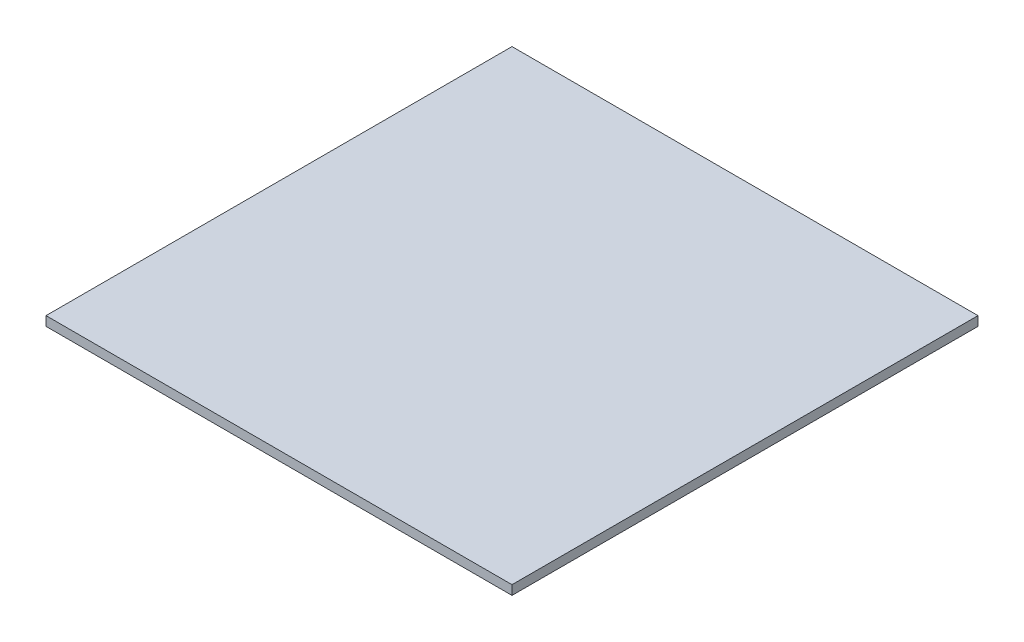
ISO-10303-21;
HEADER;
FILE_DESCRIPTION(('STEP AP214'),'2;1');
FILE_NAME('part.step','',(''),(''),'','','');
FILE_SCHEMA(('AUTOMOTIVE_DESIGN { 1 0 10303 214 1 1 1 1 }'));
ENDSEC;
DATA;
#1=APPLICATION_CONTEXT('core data for automotive mechanical design processes');
#2=APPLICATION_PROTOCOL_DEFINITION('international standard','automotive_design',2000,#1);
#3=PRODUCT_CONTEXT('',#1,'mechanical');
#4=PRODUCT('Part','Part','',(#3));
#5=PRODUCT_RELATED_PRODUCT_CATEGORY('part','',(#4));
#6=PRODUCT_DEFINITION_FORMATION('','',#4);
#7=PRODUCT_DEFINITION_CONTEXT('part definition',#1,'design');
#8=PRODUCT_DEFINITION('design','',#6,#7);
#9=PRODUCT_DEFINITION_SHAPE('','',#8);
#10=(LENGTH_UNIT() NAMED_UNIT(*) SI_UNIT(.MILLI.,.METRE.));
#11=(NAMED_UNIT(*) PLANE_ANGLE_UNIT() SI_UNIT($,.RADIAN.));
#12=(NAMED_UNIT(*) SI_UNIT($,.STERADIAN.) SOLID_ANGLE_UNIT());
#13=UNCERTAINTY_MEASURE_WITH_UNIT(LENGTH_MEASURE(1.E-05),#10,'distance_accuracy_value','');
#14=(GEOMETRIC_REPRESENTATION_CONTEXT(3) GLOBAL_UNCERTAINTY_ASSIGNED_CONTEXT((#13)) GLOBAL_UNIT_ASSIGNED_CONTEXT((#10,
#11,#12)) REPRESENTATION_CONTEXT('',''));
#15=CARTESIAN_POINT('',(0.,0.,0.));
#16=DIRECTION('',(0.,0.,1.));
#17=DIRECTION('',(1.,0.,0.));
#18=AXIS2_PLACEMENT_3D('',#15,#16,#17);
#19=CARTESIAN_POINT('',(0.,4.,0.));
#20=DIRECTION('',(1.,0.,0.));
#21=DIRECTION('',(0.,0.,-1.));
#22=AXIS2_PLACEMENT_3D('',#19,#20,#21);
#23=PLANE('',#22);
#24=DIRECTION('',(0.,0.,1.));
#25=VECTOR('',#24,1.);
#26=CARTESIAN_POINT('',(0.,0.,0.));
#27=LINE('',#26,#25);
#28=CARTESIAN_POINT('',(0.,0.,-200.));
#29=VERTEX_POINT('',#28);
#30=CARTESIAN_POINT('',(0.,0.,0.));
#31=VERTEX_POINT('',#30);
#32=EDGE_CURVE('E95',#29,#31,#27,.T.);
#33=ORIENTED_EDGE('',*,*,#32,.T.);
#34=DIRECTION('',(0.,-1.,0.));
#35=VECTOR('',#34,1.);
#36=CARTESIAN_POINT('',(0.,4.,0.));
#37=LINE('',#36,#35);
#38=CARTESIAN_POINT('',(0.,4.,0.));
#39=VERTEX_POINT('',#38);
#40=EDGE_CURVE('E11',#39,#31,#37,.T.);
#41=ORIENTED_EDGE('',*,*,#40,.F.);
#42=DIRECTION('',(0.,0.,1.));
#43=VECTOR('',#42,1.);
#44=CARTESIAN_POINT('',(0.,4.,0.));
#45=LINE('',#44,#43);
#46=CARTESIAN_POINT('',(0.,4.,-200.));
#47=VERTEX_POINT('',#46);
#48=EDGE_CURVE('E83',#47,#39,#45,.T.);
#49=ORIENTED_EDGE('',*,*,#48,.F.);
#50=DIRECTION('',(0.,-1.,0.));
#51=VECTOR('',#50,1.);
#52=CARTESIAN_POINT('',(0.,4.,-200.));
#53=LINE('',#52,#51);
#54=EDGE_CURVE('E91',#47,#29,#53,.T.);
#55=ORIENTED_EDGE('',*,*,#54,.T.);
#56=EDGE_LOOP('',(#33,#41,#49,#55));
#57=FACE_BOUND('',#56,.T.);
#58=ADVANCED_FACE('F32',(#57),#23,.F.);
#59=CARTESIAN_POINT('',(0.,4.,0.));
#60=DIRECTION('',(0.,0.,-1.));
#61=DIRECTION('',(-1.,0.,0.));
#62=AXIS2_PLACEMENT_3D('',#59,#60,#61);
#63=PLANE('',#62);
#64=DIRECTION('',(1.,0.,0.));
#65=VECTOR('',#64,1.);
#66=CARTESIAN_POINT('',(0.,0.,0.));
#67=LINE('',#66,#65);
#68=CARTESIAN_POINT('',(200.,0.,0.));
#69=VERTEX_POINT('',#68);
#70=EDGE_CURVE('E87',#31,#69,#67,.T.);
#71=ORIENTED_EDGE('',*,*,#70,.T.);
#72=DIRECTION('',(0.,-1.,0.));
#73=VECTOR('',#72,1.);
#74=CARTESIAN_POINT('',(200.,4.,0.));
#75=LINE('',#74,#73);
#76=CARTESIAN_POINT('',(200.,4.,0.));
#77=VERTEX_POINT('',#76);
#78=EDGE_CURVE('E40',#77,#69,#75,.T.);
#79=ORIENTED_EDGE('',*,*,#78,.F.);
#80=DIRECTION('',(1.,0.,0.));
#81=VECTOR('',#80,1.);
#82=CARTESIAN_POINT('',(0.,4.,0.));
#83=LINE('',#82,#81);
#84=EDGE_CURVE('E78',#39,#77,#83,.T.);
#85=ORIENTED_EDGE('',*,*,#84,.F.);
#86=ORIENTED_EDGE('',*,*,#40,.T.);
#87=EDGE_LOOP('',(#71,#79,#85,#86));
#88=FACE_BOUND('',#87,.T.);
#89=ADVANCED_FACE('F86',(#88),#63,.F.);
#90=CARTESIAN_POINT('',(200.,4.,0.));
#91=DIRECTION('',(-1.,0.,0.));
#92=DIRECTION('',(0.,0.,1.));
#93=AXIS2_PLACEMENT_3D('',#90,#91,#92);
#94=PLANE('',#93);
#95=DIRECTION('',(0.,0.,-1.));
#96=VECTOR('',#95,1.);
#97=CARTESIAN_POINT('',(200.,0.,0.));
#98=LINE('',#97,#96);
#99=CARTESIAN_POINT('',(200.,0.,-200.));
#100=VERTEX_POINT('',#99);
#101=EDGE_CURVE('E65',#69,#100,#98,.T.);
#102=ORIENTED_EDGE('',*,*,#101,.T.);
#103=DIRECTION('',(0.,-1.,0.));
#104=VECTOR('',#103,1.);
#105=CARTESIAN_POINT('',(200.,4.,-200.));
#106=LINE('',#105,#104);
#107=CARTESIAN_POINT('',(200.,4.,-200.));
#108=VERTEX_POINT('',#107);
#109=EDGE_CURVE('E88',#108,#100,#106,.T.);
#110=ORIENTED_EDGE('',*,*,#109,.F.);
#111=DIRECTION('',(0.,0.,-1.));
#112=VECTOR('',#111,1.);
#113=CARTESIAN_POINT('',(200.,4.,0.));
#114=LINE('',#113,#112);
#115=EDGE_CURVE('E81',#77,#108,#114,.T.);
#116=ORIENTED_EDGE('',*,*,#115,.F.);
#117=ORIENTED_EDGE('',*,*,#78,.T.);
#118=EDGE_LOOP('',(#102,#110,#116,#117));
#119=FACE_BOUND('',#118,.T.);
#120=ADVANCED_FACE('F89',(#119),#94,.F.);
#121=CARTESIAN_POINT('',(0.,4.,-200.));
#122=DIRECTION('',(0.,0.,1.));
#123=DIRECTION('',(1.,0.,0.));
#124=AXIS2_PLACEMENT_3D('',#121,#122,#123);
#125=PLANE('',#124);
#126=DIRECTION('',(-1.,0.,0.));
#127=VECTOR('',#126,1.);
#128=CARTESIAN_POINT('',(0.,0.,-200.));
#129=LINE('',#128,#127);
#130=EDGE_CURVE('E71',#100,#29,#129,.T.);
#131=ORIENTED_EDGE('',*,*,#130,.T.);
#132=ORIENTED_EDGE('',*,*,#54,.F.);
#133=DIRECTION('',(-1.,0.,0.));
#134=VECTOR('',#133,1.);
#135=CARTESIAN_POINT('',(0.,4.,-200.));
#136=LINE('',#135,#134);
#137=EDGE_CURVE('E48',#108,#47,#136,.T.);
#138=ORIENTED_EDGE('',*,*,#137,.F.);
#139=ORIENTED_EDGE('',*,*,#109,.T.);
#140=EDGE_LOOP('',(#131,#132,#138,#139));
#141=FACE_BOUND('',#140,.T.);
#142=ADVANCED_FACE('F102',(#141),#125,.F.);
#143=CARTESIAN_POINT('',(0.,4.,0.));
#144=DIRECTION('',(0.,-1.,0.));
#145=DIRECTION('',(0.,0.,-1.));
#146=AXIS2_PLACEMENT_3D('',#143,#144,#145);
#147=PLANE('',#146);
#148=ORIENTED_EDGE('',*,*,#48,.T.);
#149=ORIENTED_EDGE('',*,*,#84,.T.);
#150=ORIENTED_EDGE('',*,*,#115,.T.);
#151=ORIENTED_EDGE('',*,*,#137,.T.);
#152=EDGE_LOOP('',(#148,#149,#150,#151));
#153=FACE_BOUND('',#152,.T.);
#154=ADVANCED_FACE('F79',(#153),#147,.F.);
#155=CARTESIAN_POINT('',(0.,0.,0.));
#156=DIRECTION('',(0.,-1.,0.));
#157=DIRECTION('',(0.,0.,-1.));
#158=AXIS2_PLACEMENT_3D('',#155,#156,#157);
#159=PLANE('',#158);
#160=ORIENTED_EDGE('',*,*,#32,.F.);
#161=ORIENTED_EDGE('',*,*,#130,.F.);
#162=ORIENTED_EDGE('',*,*,#101,.F.);
#163=ORIENTED_EDGE('',*,*,#70,.F.);
#164=EDGE_LOOP('',(#160,#161,#162,#163));
#165=FACE_BOUND('',#164,.T.);
#166=ADVANCED_FACE('F105',(#165),#159,.T.);
#167=CLOSED_SHELL('',(#58,#89,#120,#142,#154,#166));
#168=MANIFOLD_SOLID_BREP('B2',#167);
#169=ADVANCED_BREP_SHAPE_REPRESENTATION('',(#18,#168),#14);
#170=SHAPE_DEFINITION_REPRESENTATION(#9,#169);
ENDSEC;
END-ISO-10303-21;
